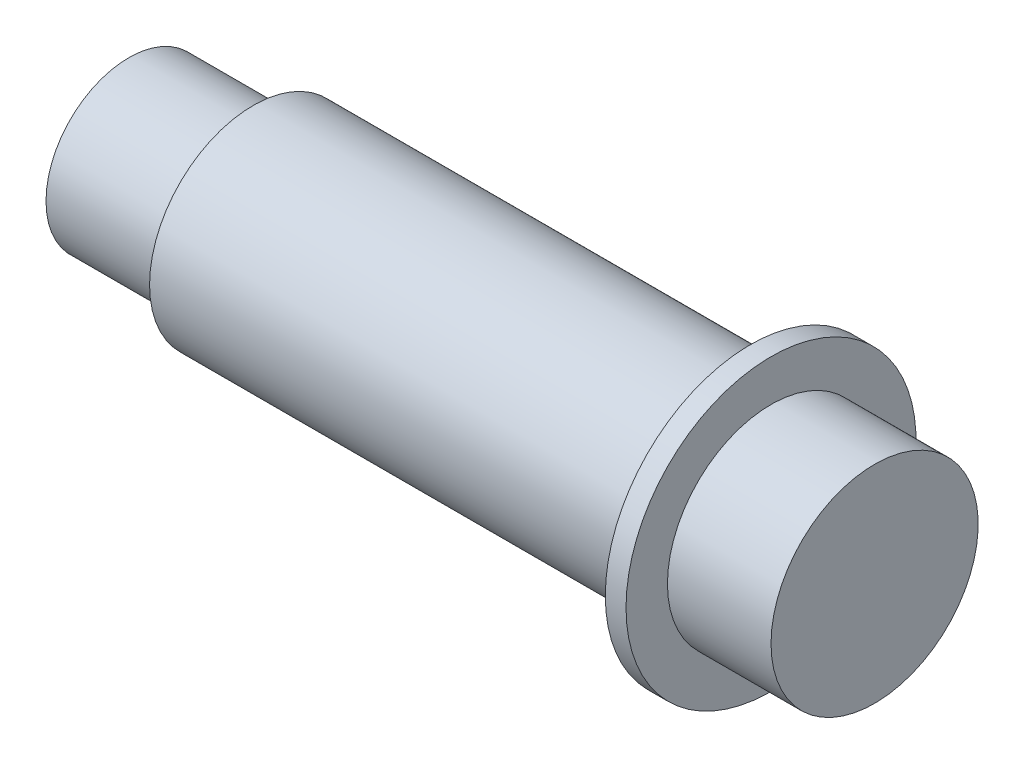
ISO-10303-21;
HEADER;
FILE_DESCRIPTION(('STEP AP214'),'2;1');
FILE_NAME('part.step','',(''),(''),'','','');
FILE_SCHEMA(('AUTOMOTIVE_DESIGN { 1 0 10303 214 1 1 1 1 }'));
ENDSEC;
DATA;
#1=APPLICATION_CONTEXT('core data for automotive mechanical design processes');
#2=APPLICATION_PROTOCOL_DEFINITION('international standard','automotive_design',2000,#1);
#3=PRODUCT_CONTEXT('',#1,'mechanical');
#4=PRODUCT('Part','Part','',(#3));
#5=PRODUCT_RELATED_PRODUCT_CATEGORY('part','',(#4));
#6=PRODUCT_DEFINITION_FORMATION('','',#4);
#7=PRODUCT_DEFINITION_CONTEXT('part definition',#1,'design');
#8=PRODUCT_DEFINITION('design','',#6,#7);
#9=PRODUCT_DEFINITION_SHAPE('','',#8);
#10=(LENGTH_UNIT() NAMED_UNIT(*) SI_UNIT(.MILLI.,.METRE.));
#11=(NAMED_UNIT(*) PLANE_ANGLE_UNIT() SI_UNIT($,.RADIAN.));
#12=(NAMED_UNIT(*) SI_UNIT($,.STERADIAN.) SOLID_ANGLE_UNIT());
#13=UNCERTAINTY_MEASURE_WITH_UNIT(LENGTH_MEASURE(1.E-05),#10,'distance_accuracy_value','');
#14=(GEOMETRIC_REPRESENTATION_CONTEXT(3) GLOBAL_UNCERTAINTY_ASSIGNED_CONTEXT((#13)) GLOBAL_UNIT_ASSIGNED_CONTEXT((#10,
#11,#12)) REPRESENTATION_CONTEXT('',''));
#15=CARTESIAN_POINT('',(0.,0.,0.));
#16=DIRECTION('',(0.,0.,1.));
#17=DIRECTION('',(1.,0.,0.));
#18=AXIS2_PLACEMENT_3D('',#15,#16,#17);
#19=CARTESIAN_POINT('',(0.,0.,0.));
#20=DIRECTION('',(1.,0.,0.));
#21=DIRECTION('',(0.,0.,-1.));
#22=AXIS2_PLACEMENT_3D('',#19,#20,#21);
#23=PLANE('',#22);
#24=CARTESIAN_POINT('',(0.,0.,0.));
#25=DIRECTION('',(-1.,0.,0.));
#26=DIRECTION('',(0.,0.,1.));
#27=AXIS2_PLACEMENT_3D('',#24,#25,#26);
#28=CIRCLE('',#27,2.);
#29=CARTESIAN_POINT('',(0.,0.,2.));
#30=VERTEX_POINT('',#29);
#31=EDGE_CURVE('E10',#30,#30,#28,.T.);
#32=ORIENTED_EDGE('',*,*,#31,.T.);
#33=EDGE_LOOP('',(#32));
#34=FACE_BOUND('',#33,.T.);
#35=ADVANCED_FACE('F30',(#34),#23,.F.);
#36=CARTESIAN_POINT('',(0.,0.,0.));
#37=DIRECTION('',(-1.,0.,0.));
#38=DIRECTION('',(0.,0.,1.));
#39=AXIS2_PLACEMENT_3D('',#36,#37,#38);
#40=CYLINDRICAL_SURFACE('',#39,2.);
#41=ORIENTED_EDGE('',*,*,#31,.F.);
#42=EDGE_LOOP('',(#41));
#43=FACE_BOUND('',#42,.T.);
#44=CARTESIAN_POINT('',(3.,0.,0.));
#45=DIRECTION('',(-1.,0.,0.));
#46=DIRECTION('',(0.,0.,1.));
#47=AXIS2_PLACEMENT_3D('',#44,#45,#46);
#48=CIRCLE('',#47,2.);
#49=CARTESIAN_POINT('',(3.,0.,2.));
#50=VERTEX_POINT('',#49);
#51=EDGE_CURVE('E36',#50,#50,#48,.T.);
#52=ORIENTED_EDGE('',*,*,#51,.T.);
#53=EDGE_LOOP('',(#52));
#54=FACE_BOUND('',#53,.T.);
#55=ADVANCED_FACE('F74',(#43,#54),#40,.T.);
#56=CARTESIAN_POINT('',(3.,2.,0.));
#57=DIRECTION('',(1.,0.,0.));
#58=DIRECTION('',(0.,0.,-1.));
#59=AXIS2_PLACEMENT_3D('',#56,#57,#58);
#60=PLANE('',#59);
#61=ORIENTED_EDGE('',*,*,#51,.F.);
#62=EDGE_LOOP('',(#61));
#63=FACE_BOUND('',#62,.T.);
#64=CARTESIAN_POINT('',(3.,0.,0.));
#65=DIRECTION('',(-1.,0.,0.));
#66=DIRECTION('',(0.,0.,1.));
#67=AXIS2_PLACEMENT_3D('',#64,#65,#66);
#68=CIRCLE('',#67,2.5);
#69=CARTESIAN_POINT('',(3.,0.,2.5));
#70=VERTEX_POINT('',#69);
#71=EDGE_CURVE('E40',#70,#70,#68,.T.);
#72=ORIENTED_EDGE('',*,*,#71,.T.);
#73=EDGE_LOOP('',(#72));
#74=FACE_BOUND('',#73,.T.);
#75=ADVANCED_FACE('F78',(#63,#74),#60,.F.);
#76=CARTESIAN_POINT('',(0.,0.,0.));
#77=DIRECTION('',(-1.,0.,0.));
#78=DIRECTION('',(0.,0.,1.));
#79=AXIS2_PLACEMENT_3D('',#76,#77,#78);
#80=CYLINDRICAL_SURFACE('',#79,2.5);
#81=ORIENTED_EDGE('',*,*,#71,.F.);
#82=EDGE_LOOP('',(#81));
#83=FACE_BOUND('',#82,.T.);
#84=CARTESIAN_POINT('',(15.,0.,0.));
#85=DIRECTION('',(-1.,0.,0.));
#86=DIRECTION('',(0.,0.,1.));
#87=AXIS2_PLACEMENT_3D('',#84,#85,#86);
#88=CIRCLE('',#87,2.5);
#89=CARTESIAN_POINT('',(15.,0.,2.5));
#90=VERTEX_POINT('',#89);
#91=EDGE_CURVE('E44',#90,#90,#88,.T.);
#92=ORIENTED_EDGE('',*,*,#91,.T.);
#93=EDGE_LOOP('',(#92));
#94=FACE_BOUND('',#93,.T.);
#95=ADVANCED_FACE('F83',(#83,#94),#80,.T.);
#96=CARTESIAN_POINT('',(15.,2.5,0.));
#97=DIRECTION('',(1.,0.,0.));
#98=DIRECTION('',(0.,0.,-1.));
#99=AXIS2_PLACEMENT_3D('',#96,#97,#98);
#100=PLANE('',#99);
#101=ORIENTED_EDGE('',*,*,#91,.F.);
#102=EDGE_LOOP('',(#101));
#103=FACE_BOUND('',#102,.T.);
#104=CARTESIAN_POINT('',(15.,0.,0.));
#105=DIRECTION('',(-1.,0.,0.));
#106=DIRECTION('',(0.,0.,1.));
#107=AXIS2_PLACEMENT_3D('',#104,#105,#106);
#108=CIRCLE('',#107,3.5);
#109=CARTESIAN_POINT('',(15.,0.,3.5));
#110=VERTEX_POINT('',#109);
#111=EDGE_CURVE('E49',#110,#110,#108,.T.);
#112=ORIENTED_EDGE('',*,*,#111,.T.);
#113=EDGE_LOOP('',(#112));
#114=FACE_BOUND('',#113,.T.);
#115=ADVANCED_FACE('F89',(#103,#114),#100,.F.);
#116=CARTESIAN_POINT('',(0.,0.,0.));
#117=DIRECTION('',(-1.,0.,0.));
#118=DIRECTION('',(0.,0.,1.));
#119=AXIS2_PLACEMENT_3D('',#116,#117,#118);
#120=CYLINDRICAL_SURFACE('',#119,3.5);
#121=ORIENTED_EDGE('',*,*,#111,.F.);
#122=EDGE_LOOP('',(#121));
#123=FACE_BOUND('',#122,.T.);
#124=CARTESIAN_POINT('',(15.5,0.,0.));
#125=DIRECTION('',(-1.,0.,0.));
#126=DIRECTION('',(0.,0.,1.));
#127=AXIS2_PLACEMENT_3D('',#124,#125,#126);
#128=CIRCLE('',#127,3.5);
#129=CARTESIAN_POINT('',(15.5,0.,3.5));
#130=VERTEX_POINT('',#129);
#131=EDGE_CURVE('E52',#130,#130,#128,.T.);
#132=ORIENTED_EDGE('',*,*,#131,.T.);
#133=EDGE_LOOP('',(#132));
#134=FACE_BOUND('',#133,.T.);
#135=ADVANCED_FACE('F93',(#123,#134),#120,.T.);
#136=CARTESIAN_POINT('',(15.5,3.5,0.));
#137=DIRECTION('',(-1.,0.,0.));
#138=DIRECTION('',(0.,0.,1.));
#139=AXIS2_PLACEMENT_3D('',#136,#137,#138);
#140=PLANE('',#139);
#141=ORIENTED_EDGE('',*,*,#131,.F.);
#142=EDGE_LOOP('',(#141));
#143=FACE_BOUND('',#142,.T.);
#144=CARTESIAN_POINT('',(15.5,0.,0.));
#145=DIRECTION('',(-1.,0.,0.));
#146=DIRECTION('',(0.,0.,1.));
#147=AXIS2_PLACEMENT_3D('',#144,#145,#146);
#148=CIRCLE('',#147,2.5);
#149=CARTESIAN_POINT('',(15.5,0.,2.5));
#150=VERTEX_POINT('',#149);
#151=EDGE_CURVE('E55',#150,#150,#148,.T.);
#152=ORIENTED_EDGE('',*,*,#151,.T.);
#153=EDGE_LOOP('',(#152));
#154=FACE_BOUND('',#153,.T.);
#155=ADVANCED_FACE('F70',(#143,#154),#140,.F.);
#156=CARTESIAN_POINT('',(0.,0.,0.));
#157=DIRECTION('',(-1.,0.,0.));
#158=DIRECTION('',(0.,0.,1.));
#159=AXIS2_PLACEMENT_3D('',#156,#157,#158);
#160=CYLINDRICAL_SURFACE('',#159,2.5);
#161=ORIENTED_EDGE('',*,*,#151,.F.);
#162=EDGE_LOOP('',(#161));
#163=FACE_BOUND('',#162,.T.);
#164=CARTESIAN_POINT('',(18.,0.,0.));
#165=DIRECTION('',(-1.,0.,0.));
#166=DIRECTION('',(0.,0.,1.));
#167=AXIS2_PLACEMENT_3D('',#164,#165,#166);
#168=CIRCLE('',#167,2.5);
#169=CARTESIAN_POINT('',(18.,0.,2.5));
#170=VERTEX_POINT('',#169);
#171=EDGE_CURVE('E58',#170,#170,#168,.T.);
#172=ORIENTED_EDGE('',*,*,#171,.T.);
#173=EDGE_LOOP('',(#172));
#174=FACE_BOUND('',#173,.T.);
#175=ADVANCED_FACE('F62',(#163,#174),#160,.T.);
#176=CARTESIAN_POINT('',(18.,2.5,0.));
#177=DIRECTION('',(-1.,0.,0.));
#178=DIRECTION('',(0.,0.,1.));
#179=AXIS2_PLACEMENT_3D('',#176,#177,#178);
#180=PLANE('',#179);
#181=ORIENTED_EDGE('',*,*,#171,.F.);
#182=EDGE_LOOP('',(#181));
#183=FACE_BOUND('',#182,.T.);
#184=ADVANCED_FACE('F64',(#183),#180,.F.);
#185=CLOSED_SHELL('',(#35,#55,#75,#95,#115,#135,#155,#175,#184));
#186=MANIFOLD_SOLID_BREP('B2',#185);
#187=ADVANCED_BREP_SHAPE_REPRESENTATION('',(#18,#186),#14);
#188=SHAPE_DEFINITION_REPRESENTATION(#9,#187);
ENDSEC;
END-ISO-10303-21;
